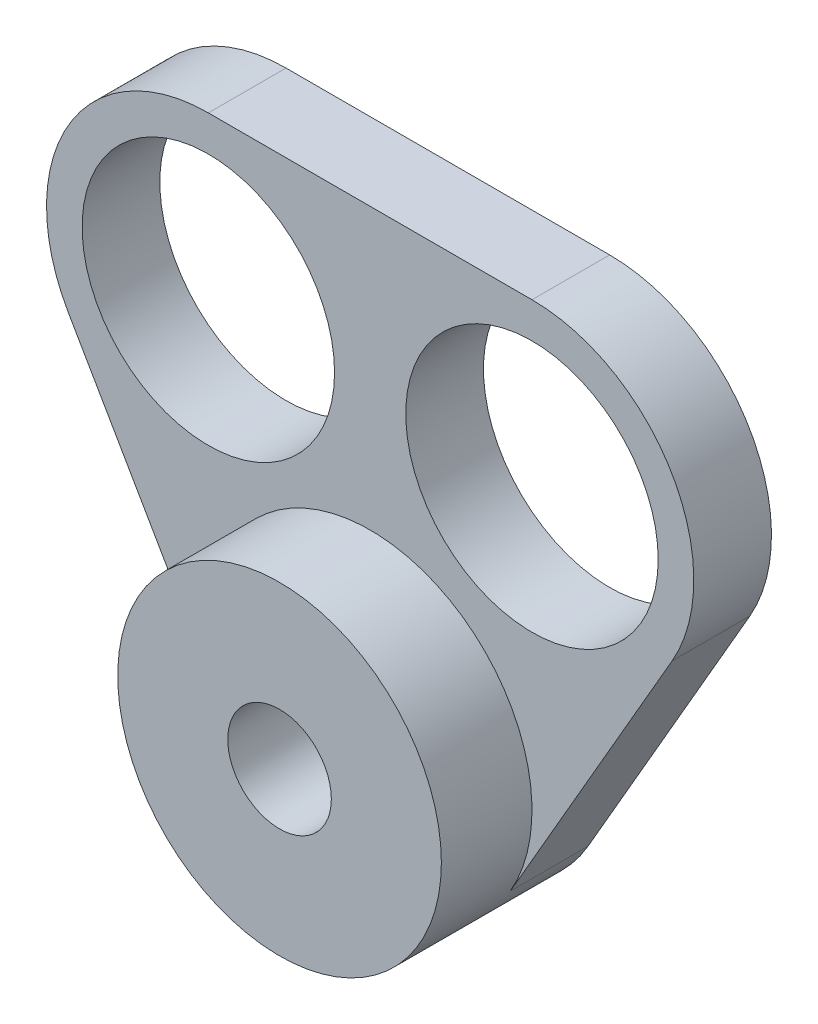
ISO-10303-21;
HEADER;
FILE_DESCRIPTION(('STEP AP214'),'2;1');
FILE_NAME('part.step','',(''),(''),'','','');
FILE_SCHEMA(('AUTOMOTIVE_DESIGN { 1 0 10303 214 1 1 1 1 }'));
ENDSEC;
DATA;
#1=APPLICATION_CONTEXT('core data for automotive mechanical design processes');
#2=APPLICATION_PROTOCOL_DEFINITION('international standard','automotive_design',2000,#1);
#3=PRODUCT_CONTEXT('',#1,'mechanical');
#4=PRODUCT('Part','Part','',(#3));
#5=PRODUCT_RELATED_PRODUCT_CATEGORY('part','',(#4));
#6=PRODUCT_DEFINITION_FORMATION('','',#4);
#7=PRODUCT_DEFINITION_CONTEXT('part definition',#1,'design');
#8=PRODUCT_DEFINITION('design','',#6,#7);
#9=PRODUCT_DEFINITION_SHAPE('','',#8);
#10=(LENGTH_UNIT() NAMED_UNIT(*) SI_UNIT(.MILLI.,.METRE.));
#11=(NAMED_UNIT(*) PLANE_ANGLE_UNIT() SI_UNIT($,.RADIAN.));
#12=(NAMED_UNIT(*) SI_UNIT($,.STERADIAN.) SOLID_ANGLE_UNIT());
#13=UNCERTAINTY_MEASURE_WITH_UNIT(LENGTH_MEASURE(1.E-05),#10,'distance_accuracy_value','');
#14=(GEOMETRIC_REPRESENTATION_CONTEXT(3) GLOBAL_UNCERTAINTY_ASSIGNED_CONTEXT((#13)) GLOBAL_UNIT_ASSIGNED_CONTEXT((#10,
#11,#12)) REPRESENTATION_CONTEXT('',''));
#15=CARTESIAN_POINT('',(0.,0.,0.));
#16=DIRECTION('',(0.,0.,1.));
#17=DIRECTION('',(1.,0.,0.));
#18=AXIS2_PLACEMENT_3D('',#15,#16,#17);
#19=CARTESIAN_POINT('',(0.,0.,6.));
#20=DIRECTION('',(0.,0.,-1.));
#21=DIRECTION('',(-1.,0.,0.));
#22=AXIS2_PLACEMENT_3D('',#19,#20,#21);
#23=CYLINDRICAL_SURFACE('',#22,12.5);
#24=CARTESIAN_POINT('',(0.,0.,0.));
#25=DIRECTION('',(0.,0.,1.));
#26=DIRECTION('',(1.,0.,0.));
#27=AXIS2_PLACEMENT_3D('',#24,#25,#26);
#28=CIRCLE('',#27,12.5);
#29=CARTESIAN_POINT('',(-10.8253175473055,-6.25,0.));
#30=VERTEX_POINT('',#29);
#31=CARTESIAN_POINT('',(10.8253175473055,-6.25,0.));
#32=VERTEX_POINT('',#31);
#33=EDGE_CURVE('E132',#30,#32,#28,.T.);
#34=ORIENTED_EDGE('',*,*,#33,.T.);
#35=DIRECTION('',(0.,0.,-1.));
#36=VECTOR('',#35,1.);
#37=CARTESIAN_POINT('',(10.8253175473055,-6.25,6.));
#38=LINE('',#37,#36);
#39=CARTESIAN_POINT('',(10.8253175473055,-6.25,6.));
#40=VERTEX_POINT('',#39);
#41=EDGE_CURVE('E38',#40,#32,#38,.T.);
#42=ORIENTED_EDGE('',*,*,#41,.F.);
#43=CARTESIAN_POINT('',(0.,0.,6.));
#44=DIRECTION('',(0.,0.,1.));
#45=DIRECTION('',(1.,0.,0.));
#46=AXIS2_PLACEMENT_3D('',#43,#44,#45);
#47=CIRCLE('',#46,12.5);
#48=CARTESIAN_POINT('',(-10.8253175473055,-6.25,6.));
#49=VERTEX_POINT('',#48);
#50=EDGE_CURVE('E11',#40,#49,#47,.T.);
#51=ORIENTED_EDGE('',*,*,#50,.T.);
#52=DIRECTION('',(0.,0.,-1.));
#53=VECTOR('',#52,1.);
#54=CARTESIAN_POINT('',(-10.8253175473055,-6.25,6.));
#55=LINE('',#54,#53);
#56=EDGE_CURVE('E128',#49,#30,#55,.T.);
#57=ORIENTED_EDGE('',*,*,#56,.T.);
#58=EDGE_LOOP('',(#34,#42,#51,#57));
#59=FACE_BOUND('',#58,.T.);
#60=CARTESIAN_POINT('',(0.,0.,13.));
#61=DIRECTION('',(0.,0.,1.));
#62=DIRECTION('',(1.,0.,0.));
#63=AXIS2_PLACEMENT_3D('',#60,#61,#62);
#64=CIRCLE('',#63,12.5);
#65=CARTESIAN_POINT('',(12.5,0.,13.));
#66=VERTEX_POINT('',#65);
#67=EDGE_CURVE('E133',#66,#66,#64,.T.);
#68=ORIENTED_EDGE('',*,*,#67,.F.);
#69=EDGE_LOOP('',(#68));
#70=FACE_BOUND('',#69,.T.);
#71=ADVANCED_FACE('F35',(#59,#70),#23,.T.);
#72=CARTESIAN_POINT('',(10.8253175473055,-6.25,6.));
#73=DIRECTION('',(-0.866025403784439,0.5,0.));
#74=DIRECTION('',(-0.5,-0.866025403784439,0.));
#75=AXIS2_PLACEMENT_3D('',#72,#73,#74);
#76=PLANE('',#75);
#77=DIRECTION('',(0.5,0.866025403784439,0.));
#78=VECTOR('',#77,1.);
#79=CARTESIAN_POINT('',(10.8253175473055,-6.25,0.));
#80=LINE('',#79,#78);
#81=CARTESIAN_POINT('',(23.3253175473055,15.400635094611,0.));
#82=VERTEX_POINT('',#81);
#83=EDGE_CURVE('E136',#32,#82,#80,.T.);
#84=ORIENTED_EDGE('',*,*,#83,.T.);
#85=DIRECTION('',(0.,0.,-1.));
#86=VECTOR('',#85,1.);
#87=CARTESIAN_POINT('',(23.3253175473055,15.400635094611,6.));
#88=LINE('',#87,#86);
#89=CARTESIAN_POINT('',(23.3253175473055,15.400635094611,6.));
#90=VERTEX_POINT('',#89);
#91=EDGE_CURVE('E112',#90,#82,#88,.T.);
#92=ORIENTED_EDGE('',*,*,#91,.F.);
#93=DIRECTION('',(0.5,0.866025403784439,0.));
#94=VECTOR('',#93,1.);
#95=CARTESIAN_POINT('',(10.8253175473055,-6.25,6.));
#96=LINE('',#95,#94);
#97=EDGE_CURVE('E99',#40,#90,#96,.T.);
#98=ORIENTED_EDGE('',*,*,#97,.F.);
#99=ORIENTED_EDGE('',*,*,#41,.T.);
#100=EDGE_LOOP('',(#84,#92,#98,#99));
#101=FACE_BOUND('',#100,.T.);
#102=ADVANCED_FACE('F158',(#101),#76,.F.);
#103=CARTESIAN_POINT('',(12.5,21.650635094611,6.));
#104=DIRECTION('',(0.,0.,-1.));
#105=DIRECTION('',(-1.,0.,0.));
#106=AXIS2_PLACEMENT_3D('',#103,#104,#105);
#107=CYLINDRICAL_SURFACE('',#106,12.5);
#108=CARTESIAN_POINT('',(12.5,21.650635094611,0.));
#109=DIRECTION('',(0.,0.,1.));
#110=DIRECTION('',(1.,0.,0.));
#111=AXIS2_PLACEMENT_3D('',#108,#109,#110);
#112=CIRCLE('',#111,12.5);
#113=CARTESIAN_POINT('',(12.5,34.150635094611,0.));
#114=VERTEX_POINT('',#113);
#115=EDGE_CURVE('E108',#82,#114,#112,.T.);
#116=ORIENTED_EDGE('',*,*,#115,.T.);
#117=DIRECTION('',(0.,0.,-1.));
#118=VECTOR('',#117,1.);
#119=CARTESIAN_POINT('',(12.5,34.150635094611,6.));
#120=LINE('',#119,#118);
#121=CARTESIAN_POINT('',(12.5,34.150635094611,6.));
#122=VERTEX_POINT('',#121);
#123=EDGE_CURVE('E105',#122,#114,#120,.T.);
#124=ORIENTED_EDGE('',*,*,#123,.F.);
#125=CARTESIAN_POINT('',(12.5,21.650635094611,6.));
#126=DIRECTION('',(0.,0.,1.));
#127=DIRECTION('',(1.,0.,0.));
#128=AXIS2_PLACEMENT_3D('',#125,#126,#127);
#129=CIRCLE('',#128,12.5);
#130=EDGE_CURVE('E93',#90,#122,#129,.T.);
#131=ORIENTED_EDGE('',*,*,#130,.F.);
#132=ORIENTED_EDGE('',*,*,#91,.T.);
#133=EDGE_LOOP('',(#116,#124,#131,#132));
#134=FACE_BOUND('',#133,.T.);
#135=ADVANCED_FACE('F106',(#134),#107,.T.);
#136=CARTESIAN_POINT('',(0.,34.150635094611,6.));
#137=DIRECTION('',(0.,1.,0.));
#138=DIRECTION('',(0.,0.,1.));
#139=AXIS2_PLACEMENT_3D('',#136,#137,#138);
#140=PLANE('',#139);
#141=DIRECTION('',(1.,0.,0.));
#142=VECTOR('',#141,1.);
#143=CARTESIAN_POINT('',(0.,34.150635094611,0.));
#144=LINE('',#143,#142);
#145=CARTESIAN_POINT('',(-12.5,34.150635094611,0.));
#146=VERTEX_POINT('',#145);
#147=EDGE_CURVE('E139',#146,#114,#144,.T.);
#148=ORIENTED_EDGE('',*,*,#147,.F.);
#149=DIRECTION('',(0.,0.,-1.));
#150=VECTOR('',#149,1.);
#151=CARTESIAN_POINT('',(-12.5,34.150635094611,6.));
#152=LINE('',#151,#150);
#153=CARTESIAN_POINT('',(-12.5,34.150635094611,6.));
#154=VERTEX_POINT('',#153);
#155=EDGE_CURVE('E113',#154,#146,#152,.T.);
#156=ORIENTED_EDGE('',*,*,#155,.F.);
#157=DIRECTION('',(1.,0.,0.));
#158=VECTOR('',#157,1.);
#159=CARTESIAN_POINT('',(0.,34.150635094611,6.));
#160=LINE('',#159,#158);
#161=EDGE_CURVE('E98',#154,#122,#160,.T.);
#162=ORIENTED_EDGE('',*,*,#161,.T.);
#163=ORIENTED_EDGE('',*,*,#123,.T.);
#164=EDGE_LOOP('',(#148,#156,#162,#163));
#165=FACE_BOUND('',#164,.T.);
#166=ADVANCED_FACE('F115',(#165),#140,.T.);
#167=CARTESIAN_POINT('',(-12.5,21.650635094611,6.));
#168=DIRECTION('',(0.,0.,-1.));
#169=DIRECTION('',(-1.,0.,0.));
#170=AXIS2_PLACEMENT_3D('',#167,#168,#169);
#171=CYLINDRICAL_SURFACE('',#170,12.5);
#172=CARTESIAN_POINT('',(-12.5,21.650635094611,0.));
#173=DIRECTION('',(0.,0.,1.));
#174=DIRECTION('',(1.,0.,0.));
#175=AXIS2_PLACEMENT_3D('',#172,#173,#174);
#176=CIRCLE('',#175,12.5);
#177=CARTESIAN_POINT('',(-23.3253175473055,15.400635094611,0.));
#178=VERTEX_POINT('',#177);
#179=EDGE_CURVE('E75',#146,#178,#176,.T.);
#180=ORIENTED_EDGE('',*,*,#179,.T.);
#181=DIRECTION('',(0.,0.,-1.));
#182=VECTOR('',#181,1.);
#183=CARTESIAN_POINT('',(-23.3253175473055,15.400635094611,6.));
#184=LINE('',#183,#182);
#185=CARTESIAN_POINT('',(-23.3253175473055,15.400635094611,6.));
#186=VERTEX_POINT('',#185);
#187=EDGE_CURVE('E153',#186,#178,#184,.T.);
#188=ORIENTED_EDGE('',*,*,#187,.F.);
#189=CARTESIAN_POINT('',(-12.5,21.650635094611,6.));
#190=DIRECTION('',(0.,0.,1.));
#191=DIRECTION('',(1.,0.,0.));
#192=AXIS2_PLACEMENT_3D('',#189,#190,#191);
#193=CIRCLE('',#192,12.5);
#194=EDGE_CURVE('E52',#154,#186,#193,.T.);
#195=ORIENTED_EDGE('',*,*,#194,.F.);
#196=ORIENTED_EDGE('',*,*,#155,.T.);
#197=EDGE_LOOP('',(#180,#188,#195,#196));
#198=FACE_BOUND('',#197,.T.);
#199=ADVANCED_FACE('F198',(#198),#171,.T.);
#200=CARTESIAN_POINT('',(12.5,21.650635094611,6.));
#201=DIRECTION('',(0.,0.,-1.));
#202=DIRECTION('',(-1.,0.,0.));
#203=AXIS2_PLACEMENT_3D('',#200,#201,#202);
#204=CYLINDRICAL_SURFACE('',#203,9.75);
#205=CARTESIAN_POINT('',(12.5,21.650635094611,6.));
#206=DIRECTION('',(0.,0.,1.));
#207=DIRECTION('',(1.,0.,0.));
#208=AXIS2_PLACEMENT_3D('',#205,#206,#207);
#209=CIRCLE('',#208,9.75);
#210=CARTESIAN_POINT('',(22.25,21.650635094611,6.));
#211=VERTEX_POINT('',#210);
#212=EDGE_CURVE('E125',#211,#211,#209,.T.);
#213=ORIENTED_EDGE('',*,*,#212,.T.);
#214=EDGE_LOOP('',(#213));
#215=FACE_BOUND('',#214,.T.);
#216=CARTESIAN_POINT('',(12.5,21.650635094611,0.));
#217=DIRECTION('',(0.,0.,1.));
#218=DIRECTION('',(1.,0.,0.));
#219=AXIS2_PLACEMENT_3D('',#216,#217,#218);
#220=CIRCLE('',#219,9.75);
#221=CARTESIAN_POINT('',(22.25,21.650635094611,0.));
#222=VERTEX_POINT('',#221);
#223=EDGE_CURVE('E146',#222,#222,#220,.T.);
#224=ORIENTED_EDGE('',*,*,#223,.F.);
#225=EDGE_LOOP('',(#224));
#226=FACE_BOUND('',#225,.T.);
#227=ADVANCED_FACE('F200',(#215,#226),#204,.F.);
#228=CARTESIAN_POINT('',(-12.5,21.650635094611,6.));
#229=DIRECTION('',(0.,0.,-1.));
#230=DIRECTION('',(-1.,0.,0.));
#231=AXIS2_PLACEMENT_3D('',#228,#229,#230);
#232=CYLINDRICAL_SURFACE('',#231,9.75);
#233=CARTESIAN_POINT('',(-12.5,21.650635094611,6.));
#234=DIRECTION('',(0.,0.,1.));
#235=DIRECTION('',(1.,0.,0.));
#236=AXIS2_PLACEMENT_3D('',#233,#234,#235);
#237=CIRCLE('',#236,9.75);
#238=CARTESIAN_POINT('',(-2.75,21.650635094611,6.));
#239=VERTEX_POINT('',#238);
#240=EDGE_CURVE('E122',#239,#239,#237,.T.);
#241=ORIENTED_EDGE('',*,*,#240,.T.);
#242=EDGE_LOOP('',(#241));
#243=FACE_BOUND('',#242,.T.);
#244=CARTESIAN_POINT('',(-12.5,21.650635094611,0.));
#245=DIRECTION('',(0.,0.,1.));
#246=DIRECTION('',(1.,0.,0.));
#247=AXIS2_PLACEMENT_3D('',#244,#245,#246);
#248=CIRCLE('',#247,9.75);
#249=CARTESIAN_POINT('',(-2.75,21.650635094611,0.));
#250=VERTEX_POINT('',#249);
#251=EDGE_CURVE('E143',#250,#250,#248,.T.);
#252=ORIENTED_EDGE('',*,*,#251,.F.);
#253=EDGE_LOOP('',(#252));
#254=FACE_BOUND('',#253,.T.);
#255=ADVANCED_FACE('F184',(#243,#254),#232,.F.);
#256=CARTESIAN_POINT('',(-10.8253175473055,-6.25,6.));
#257=DIRECTION('',(0.866025403784438,0.5,0.));
#258=DIRECTION('',(-0.5,0.866025403784439,0.));
#259=AXIS2_PLACEMENT_3D('',#256,#257,#258);
#260=PLANE('',#259);
#261=DIRECTION('',(0.5,-0.866025403784439,0.));
#262=VECTOR('',#261,1.);
#263=CARTESIAN_POINT('',(-10.8253175473055,-6.25,0.));
#264=LINE('',#263,#262);
#265=EDGE_CURVE('E82',#178,#30,#264,.T.);
#266=ORIENTED_EDGE('',*,*,#265,.T.);
#267=ORIENTED_EDGE('',*,*,#56,.F.);
#268=DIRECTION('',(0.5,-0.866025403784439,0.));
#269=VECTOR('',#268,1.);
#270=CARTESIAN_POINT('',(-10.8253175473055,-6.25,6.));
#271=LINE('',#270,#269);
#272=EDGE_CURVE('E117',#186,#49,#271,.T.);
#273=ORIENTED_EDGE('',*,*,#272,.F.);
#274=ORIENTED_EDGE('',*,*,#187,.T.);
#275=EDGE_LOOP('',(#266,#267,#273,#274));
#276=FACE_BOUND('',#275,.T.);
#277=ADVANCED_FACE('F176',(#276),#260,.F.);
#278=CARTESIAN_POINT('',(0.,0.,6.));
#279=DIRECTION('',(0.,0.,-1.));
#280=DIRECTION('',(-1.,0.,0.));
#281=AXIS2_PLACEMENT_3D('',#278,#279,#280);
#282=CYLINDRICAL_SURFACE('',#281,9.75);
#283=CARTESIAN_POINT('',(0.,0.,6.));
#284=DIRECTION('',(0.,0.,1.));
#285=DIRECTION('',(1.,0.,0.));
#286=AXIS2_PLACEMENT_3D('',#283,#284,#285);
#287=CIRCLE('',#286,9.75);
#288=CARTESIAN_POINT('',(9.75,0.,6.));
#289=VERTEX_POINT('',#288);
#290=EDGE_CURVE('E129',#289,#289,#287,.T.);
#291=ORIENTED_EDGE('',*,*,#290,.T.);
#292=EDGE_LOOP('',(#291));
#293=FACE_BOUND('',#292,.T.);
#294=CARTESIAN_POINT('',(0.,0.,0.));
#295=DIRECTION('',(0.,0.,1.));
#296=DIRECTION('',(1.,0.,0.));
#297=AXIS2_PLACEMENT_3D('',#294,#295,#296);
#298=CIRCLE('',#297,9.75);
#299=CARTESIAN_POINT('',(9.75,0.,0.));
#300=VERTEX_POINT('',#299);
#301=EDGE_CURVE('E149',#300,#300,#298,.T.);
#302=ORIENTED_EDGE('',*,*,#301,.F.);
#303=EDGE_LOOP('',(#302));
#304=FACE_BOUND('',#303,.T.);
#305=ADVANCED_FACE('F174',(#293,#304),#282,.F.);
#306=CARTESIAN_POINT('',(0.,0.,6.));
#307=DIRECTION('',(0.,0.,1.));
#308=DIRECTION('',(1.,0.,0.));
#309=AXIS2_PLACEMENT_3D('',#306,#307,#308);
#310=PLANE('',#309);
#311=ORIENTED_EDGE('',*,*,#50,.F.);
#312=ORIENTED_EDGE('',*,*,#97,.T.);
#313=ORIENTED_EDGE('',*,*,#130,.T.);
#314=ORIENTED_EDGE('',*,*,#161,.F.);
#315=ORIENTED_EDGE('',*,*,#194,.T.);
#316=ORIENTED_EDGE('',*,*,#272,.T.);
#317=EDGE_LOOP('',(#311,#312,#313,#314,#315,#316));
#318=FACE_BOUND('',#317,.T.);
#319=ORIENTED_EDGE('',*,*,#240,.F.);
#320=EDGE_LOOP('',(#319));
#321=FACE_BOUND('',#320,.T.);
#322=ORIENTED_EDGE('',*,*,#212,.F.);
#323=EDGE_LOOP('',(#322));
#324=FACE_BOUND('',#323,.T.);
#325=ADVANCED_FACE('F95',(#318,#321,#324),#310,.T.);
#326=CARTESIAN_POINT('',(0.,0.,0.));
#327=DIRECTION('',(0.,0.,1.));
#328=DIRECTION('',(1.,0.,0.));
#329=AXIS2_PLACEMENT_3D('',#326,#327,#328);
#330=PLANE('',#329);
#331=ORIENTED_EDGE('',*,*,#33,.F.);
#332=ORIENTED_EDGE('',*,*,#265,.F.);
#333=ORIENTED_EDGE('',*,*,#179,.F.);
#334=ORIENTED_EDGE('',*,*,#147,.T.);
#335=ORIENTED_EDGE('',*,*,#115,.F.);
#336=ORIENTED_EDGE('',*,*,#83,.F.);
#337=EDGE_LOOP('',(#331,#332,#333,#334,#335,#336));
#338=FACE_BOUND('',#337,.T.);
#339=ORIENTED_EDGE('',*,*,#251,.T.);
#340=EDGE_LOOP('',(#339));
#341=FACE_BOUND('',#340,.T.);
#342=ORIENTED_EDGE('',*,*,#223,.T.);
#343=EDGE_LOOP('',(#342));
#344=FACE_BOUND('',#343,.T.);
#345=ORIENTED_EDGE('',*,*,#301,.T.);
#346=EDGE_LOOP('',(#345));
#347=FACE_BOUND('',#346,.T.);
#348=ADVANCED_FACE('F163',(#338,#341,#344,#347),#330,.F.);
#349=CARTESIAN_POINT('',(0.,0.,13.));
#350=DIRECTION('',(0.,0.,1.));
#351=DIRECTION('',(1.,0.,0.));
#352=AXIS2_PLACEMENT_3D('',#349,#350,#351);
#353=PLANE('',#352);
#354=ORIENTED_EDGE('',*,*,#67,.T.);
#355=EDGE_LOOP('',(#354));
#356=FACE_BOUND('',#355,.T.);
#357=CARTESIAN_POINT('',(0.,0.,13.));
#358=DIRECTION('',(0.,0.,1.));
#359=DIRECTION('',(1.,0.,0.));
#360=AXIS2_PLACEMENT_3D('',#357,#358,#359);
#361=CIRCLE('',#360,4.);
#362=CARTESIAN_POINT('',(4.,0.,13.));
#363=VERTEX_POINT('',#362);
#364=EDGE_CURVE('E287',#363,#363,#361,.T.);
#365=ORIENTED_EDGE('',*,*,#364,.F.);
#366=EDGE_LOOP('',(#365));
#367=FACE_BOUND('',#366,.T.);
#368=ADVANCED_FACE('F166',(#356,#367),#353,.T.);
#369=CARTESIAN_POINT('',(0.,0.,6.));
#370=DIRECTION('',(0.,0.,1.));
#371=DIRECTION('',(1.,0.,0.));
#372=AXIS2_PLACEMENT_3D('',#369,#370,#371);
#373=PLANE('',#372);
#374=ORIENTED_EDGE('',*,*,#290,.F.);
#375=EDGE_LOOP('',(#374));
#376=FACE_BOUND('',#375,.T.);
#377=CARTESIAN_POINT('',(0.,0.,6.));
#378=DIRECTION('',(0.,0.,1.));
#379=DIRECTION('',(1.,0.,0.));
#380=AXIS2_PLACEMENT_3D('',#377,#378,#379);
#381=CIRCLE('',#380,4.);
#382=CARTESIAN_POINT('',(4.,0.,6.));
#383=VERTEX_POINT('',#382);
#384=EDGE_CURVE('E290',#383,#383,#381,.T.);
#385=ORIENTED_EDGE('',*,*,#384,.T.);
#386=EDGE_LOOP('',(#385));
#387=FACE_BOUND('',#386,.T.);
#388=ADVANCED_FACE('F260',(#376,#387),#373,.F.);
#389=CARTESIAN_POINT('',(0.,0.,13.));
#390=DIRECTION('',(0.,0.,-1.));
#391=DIRECTION('',(-1.,0.,0.));
#392=AXIS2_PLACEMENT_3D('',#389,#390,#391);
#393=CYLINDRICAL_SURFACE('',#392,4.);
#394=ORIENTED_EDGE('',*,*,#364,.T.);
#395=EDGE_LOOP('',(#394));
#396=FACE_BOUND('',#395,.T.);
#397=ORIENTED_EDGE('',*,*,#384,.F.);
#398=EDGE_LOOP('',(#397));
#399=FACE_BOUND('',#398,.T.);
#400=ADVANCED_FACE('F270',(#396,#399),#393,.F.);
#401=CLOSED_SHELL('',(#71,#102,#135,#166,#199,#227,#255,#277,#305,#325,#348,#368,#388,#400));
#402=MANIFOLD_SOLID_BREP('B2',#401);
#403=ADVANCED_BREP_SHAPE_REPRESENTATION('',(#18,#402),#14);
#404=SHAPE_DEFINITION_REPRESENTATION(#9,#403);
ENDSEC;
END-ISO-10303-21;
